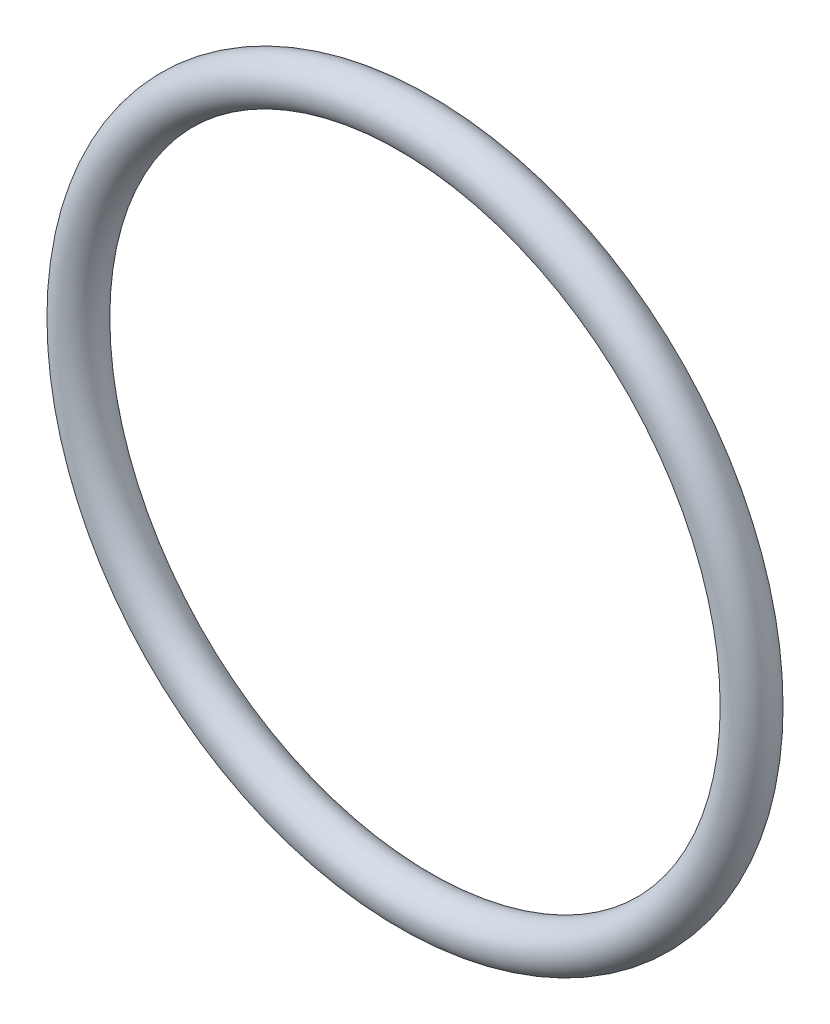
ISO-10303-21;
HEADER;
FILE_DESCRIPTION(('STEP AP214'),'2;1');
FILE_NAME('part.step','',(''),(''),'','','');
FILE_SCHEMA(('AUTOMOTIVE_DESIGN { 1 0 10303 214 1 1 1 1 }'));
ENDSEC;
DATA;
#1=APPLICATION_CONTEXT('core data for automotive mechanical design processes');
#2=APPLICATION_PROTOCOL_DEFINITION('international standard','automotive_design',2000,#1);
#3=PRODUCT_CONTEXT('',#1,'mechanical');
#4=PRODUCT('Part','Part','',(#3));
#5=PRODUCT_RELATED_PRODUCT_CATEGORY('part','',(#4));
#6=PRODUCT_DEFINITION_FORMATION('','',#4);
#7=PRODUCT_DEFINITION_CONTEXT('part definition',#1,'design');
#8=PRODUCT_DEFINITION('design','',#6,#7);
#9=PRODUCT_DEFINITION_SHAPE('','',#8);
#10=(LENGTH_UNIT() NAMED_UNIT(*) SI_UNIT(.MILLI.,.METRE.));
#11=(NAMED_UNIT(*) PLANE_ANGLE_UNIT() SI_UNIT($,.RADIAN.));
#12=(NAMED_UNIT(*) SI_UNIT($,.STERADIAN.) SOLID_ANGLE_UNIT());
#13=UNCERTAINTY_MEASURE_WITH_UNIT(LENGTH_MEASURE(1.E-05),#10,'distance_accuracy_value','');
#14=(GEOMETRIC_REPRESENTATION_CONTEXT(3) GLOBAL_UNCERTAINTY_ASSIGNED_CONTEXT((#13)) GLOBAL_UNIT_ASSIGNED_CONTEXT((#10,
#11,#12)) REPRESENTATION_CONTEXT('',''));
#15=CARTESIAN_POINT('',(0.,0.,0.));
#16=DIRECTION('',(0.,0.,1.));
#17=DIRECTION('',(1.,0.,0.));
#18=AXIS2_PLACEMENT_3D('',#15,#16,#17);
#19=CARTESIAN_POINT('',(0.,0.,0.));
#20=DIRECTION('',(0.,0.,1.));
#21=DIRECTION('',(1.,0.,0.));
#22=AXIS2_PLACEMENT_3D('',#19,#20,#21);
#23=TOROIDAL_SURFACE('',#22,13.4493,0.888999999999998);
#24=CARTESIAN_POINT('',(14.3383,0.,0.));
#25=VERTEX_POINT('',#24);
#26=VERTEX_LOOP('',#25);
#27=FACE_BOUND('',#26,.T.);
#28=ADVANCED_FACE('F37',(#27),#23,.T.);
#29=CLOSED_SHELL('',(#28));
#30=MANIFOLD_SOLID_BREP('B2',#29);
#31=ADVANCED_BREP_SHAPE_REPRESENTATION('',(#18,#30),#14);
#32=SHAPE_DEFINITION_REPRESENTATION(#9,#31);
ENDSEC;
END-ISO-10303-21;
